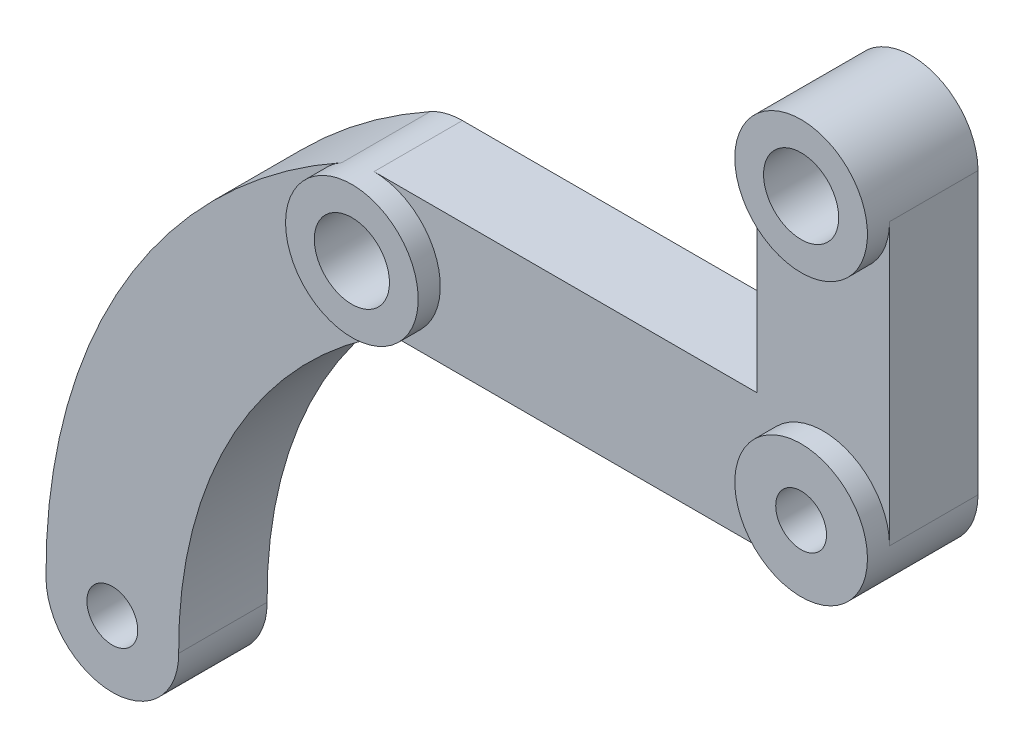
ISO-10303-21;
HEADER;
FILE_DESCRIPTION(('STEP AP214'),'2;1');
FILE_NAME('part.step','',(''),(''),'','','');
FILE_SCHEMA(('AUTOMOTIVE_DESIGN { 1 0 10303 214 1 1 1 1 }'));
ENDSEC;
DATA;
#1=APPLICATION_CONTEXT('core data for automotive mechanical design processes');
#2=APPLICATION_PROTOCOL_DEFINITION('international standard','automotive_design',2000,#1);
#3=PRODUCT_CONTEXT('',#1,'mechanical');
#4=PRODUCT('Part','Part','',(#3));
#5=PRODUCT_RELATED_PRODUCT_CATEGORY('part','',(#4));
#6=PRODUCT_DEFINITION_FORMATION('','',#4);
#7=PRODUCT_DEFINITION_CONTEXT('part definition',#1,'design');
#8=PRODUCT_DEFINITION('design','',#6,#7);
#9=PRODUCT_DEFINITION_SHAPE('','',#8);
#10=(LENGTH_UNIT() NAMED_UNIT(*) SI_UNIT(.MILLI.,.METRE.));
#11=(NAMED_UNIT(*) PLANE_ANGLE_UNIT() SI_UNIT($,.RADIAN.));
#12=(NAMED_UNIT(*) SI_UNIT($,.STERADIAN.) SOLID_ANGLE_UNIT());
#13=UNCERTAINTY_MEASURE_WITH_UNIT(LENGTH_MEASURE(1.E-05),#10,'distance_accuracy_value','');
#14=(GEOMETRIC_REPRESENTATION_CONTEXT(3) GLOBAL_UNCERTAINTY_ASSIGNED_CONTEXT((#13)) GLOBAL_UNIT_ASSIGNED_CONTEXT((#10,
#11,#12)) REPRESENTATION_CONTEXT('',''));
#15=CARTESIAN_POINT('',(0.,0.,0.));
#16=DIRECTION('',(0.,0.,1.));
#17=DIRECTION('',(1.,0.,0.));
#18=AXIS2_PLACEMENT_3D('',#15,#16,#17);
#19=CARTESIAN_POINT('',(-2.53999999999998,2.54000000000002,-5.));
#20=DIRECTION('',(0.,0.,1.));
#21=DIRECTION('',(-1.,0.,0.));
#22=AXIS2_PLACEMENT_3D('',#19,#20,#21);
#23=CYLINDRICAL_SURFACE('',#22,3.);
#24=CARTESIAN_POINT('',(-2.53999999999998,2.54000000000002,0.));
#25=DIRECTION('',(0.,0.,1.));
#26=DIRECTION('',(1.,0.,0.));
#27=AXIS2_PLACEMENT_3D('',#24,#25,#26);
#28=CIRCLE('',#27,3.);
#29=CARTESIAN_POINT('',(0.460000000000019,2.54000000000002,0.));
#30=VERTEX_POINT('',#29);
#31=EDGE_CURVE('E189',#30,#30,#28,.T.);
#32=ORIENTED_EDGE('',*,*,#31,.F.);
#33=EDGE_LOOP('',(#32));
#34=FACE_BOUND('',#33,.T.);
#35=CARTESIAN_POINT('',(-2.53999999999998,2.54000000000002,-5.));
#36=DIRECTION('',(0.,0.,1.));
#37=DIRECTION('',(1.,0.,0.));
#38=AXIS2_PLACEMENT_3D('',#35,#36,#37);
#39=CIRCLE('',#38,3.);
#40=CARTESIAN_POINT('',(-2.53999999999998,-0.459999999999989,-5.));
#41=VERTEX_POINT('',#40);
#42=CARTESIAN_POINT('',(0.460000000000041,2.54000000000002,-5.));
#43=VERTEX_POINT('',#42);
#44=EDGE_CURVE('E125',#41,#43,#39,.T.);
#45=ORIENTED_EDGE('',*,*,#44,.T.);
#46=DIRECTION('',(0.,0.,-1.));
#47=VECTOR('',#46,1.);
#48=CARTESIAN_POINT('',(0.460000000000041,2.54000000000002,14.0459958707099));
#49=LINE('',#48,#47);
#50=CARTESIAN_POINT('',(0.460000000000041,2.54000000000002,-1.00000000000001));
#51=VERTEX_POINT('',#50);
#52=EDGE_CURVE('E130',#51,#43,#49,.T.);
#53=ORIENTED_EDGE('',*,*,#52,.F.);
#54=CARTESIAN_POINT('',(-2.53999999999998,2.54000000000002,-1.00000000000001));
#55=DIRECTION('',(0.,0.,-1.));
#56=DIRECTION('',(-1.,0.,0.));
#57=AXIS2_PLACEMENT_3D('',#54,#55,#56);
#58=CIRCLE('',#57,3.);
#59=CARTESIAN_POINT('',(-2.53999999999998,-0.459999999999983,-1.00000000000001));
#60=VERTEX_POINT('',#59);
#61=EDGE_CURVE('E197',#60,#51,#58,.T.);
#62=ORIENTED_EDGE('',*,*,#61,.F.);
#63=DIRECTION('',(0.,0.,-1.));
#64=VECTOR('',#63,1.);
#65=CARTESIAN_POINT('',(-2.53999999999998,-0.459999999999983,20.1873169608612));
#66=LINE('',#65,#64);
#67=EDGE_CURVE('E143',#60,#41,#66,.T.);
#68=ORIENTED_EDGE('',*,*,#67,.T.);
#69=EDGE_LOOP('',(#45,#53,#62,#68));
#70=FACE_BOUND('',#69,.T.);
#71=ADVANCED_FACE('F39',(#34,#70),#23,.T.);
#72=CARTESIAN_POINT('',(-2.53999999999998,2.54000000000002,-5.00000000000013));
#73=DIRECTION('',(0.,0.,1.));
#74=DIRECTION('',(-1.,0.,0.));
#75=AXIS2_PLACEMENT_3D('',#72,#73,#74);
#76=CYLINDRICAL_SURFACE('',#75,1.15);
#77=CARTESIAN_POINT('',(-2.53999999999998,2.54000000000002,0.));
#78=DIRECTION('',(0.,0.,-1.));
#79=DIRECTION('',(-1.,0.,0.));
#80=AXIS2_PLACEMENT_3D('',#77,#78,#79);
#81=CIRCLE('',#80,1.15);
#82=CARTESIAN_POINT('',(-3.68999999999998,2.54000000000002,0.));
#83=VERTEX_POINT('',#82);
#84=EDGE_CURVE('E144',#83,#83,#81,.T.);
#85=ORIENTED_EDGE('',*,*,#84,.F.);
#86=EDGE_LOOP('',(#85));
#87=FACE_BOUND('',#86,.T.);
#88=CARTESIAN_POINT('',(-2.53999999999998,2.54000000000002,-5.));
#89=DIRECTION('',(0.,0.,1.));
#90=DIRECTION('',(1.,0.,0.));
#91=AXIS2_PLACEMENT_3D('',#88,#89,#90);
#92=CIRCLE('',#91,1.15);
#93=CARTESIAN_POINT('',(-1.38999999999998,2.54000000000002,-5.));
#94=VERTEX_POINT('',#93);
#95=EDGE_CURVE('E43',#94,#94,#92,.F.);
#96=ORIENTED_EDGE('',*,*,#95,.T.);
#97=EDGE_LOOP('',(#96));
#98=FACE_BOUND('',#97,.T.);
#99=ADVANCED_FACE('F268',(#87,#98),#76,.F.);
#100=CARTESIAN_POINT('',(-22.86,2.54000000000002,-5.));
#101=DIRECTION('',(0.,0.,1.));
#102=DIRECTION('',(-1.,0.,0.));
#103=AXIS2_PLACEMENT_3D('',#100,#101,#102);
#104=CYLINDRICAL_SURFACE('',#103,3.);
#105=DIRECTION('',(0.,0.,-1.));
#106=VECTOR('',#105,1.);
#107=CARTESIAN_POINT('',(-22.86,5.54000000000001,20.1873169608612));
#108=LINE('',#107,#106);
#109=CARTESIAN_POINT('',(-22.86,5.54000000000002,-1.00000000000005));
#110=VERTEX_POINT('',#109);
#111=CARTESIAN_POINT('',(-22.86,5.54000000000002,-5.));
#112=VERTEX_POINT('',#111);
#113=EDGE_CURVE('E174',#110,#112,#108,.T.);
#114=ORIENTED_EDGE('',*,*,#113,.T.);
#115=CARTESIAN_POINT('',(-22.86,2.54000000000002,-5.));
#116=DIRECTION('',(0.,0.,1.));
#117=DIRECTION('',(-1.,0.,0.));
#118=AXIS2_PLACEMENT_3D('',#115,#116,#117);
#119=CIRCLE('',#118,3.);
#120=CARTESIAN_POINT('',(-24.3161661411759,5.16289537902159,-5.));
#121=VERTEX_POINT('',#120);
#122=EDGE_CURVE('E224',#112,#121,#119,.T.);
#123=ORIENTED_EDGE('',*,*,#122,.T.);
#124=DIRECTION('',(0.,0.,1.));
#125=VECTOR('',#124,1.);
#126=CARTESIAN_POINT('',(-24.3161661411758,5.1628953790216,-35.6297382466008));
#127=LINE('',#126,#125);
#128=CARTESIAN_POINT('',(-24.3161661411759,5.1628953790216,-1.00000000000009));
#129=VERTEX_POINT('',#128);
#130=EDGE_CURVE('E212',#121,#129,#127,.T.);
#131=ORIENTED_EDGE('',*,*,#130,.T.);
#132=CARTESIAN_POINT('',(-22.86,2.54000000000002,-1.00000000000008));
#133=DIRECTION('',(0.,0.,1.));
#134=DIRECTION('',(1.,0.,0.));
#135=AXIS2_PLACEMENT_3D('',#132,#133,#134);
#136=CIRCLE('',#135,3.);
#137=EDGE_CURVE('E48',#129,#110,#136,.T.);
#138=ORIENTED_EDGE('',*,*,#137,.T.);
#139=EDGE_LOOP('',(#114,#123,#131,#138));
#140=FACE_BOUND('',#139,.T.);
#141=CARTESIAN_POINT('',(-22.86,2.54000000000002,0.));
#142=DIRECTION('',(0.,0.,1.));
#143=DIRECTION('',(-1.,0.,0.));
#144=AXIS2_PLACEMENT_3D('',#141,#142,#143);
#145=CIRCLE('',#144,3.);
#146=CARTESIAN_POINT('',(-25.86,2.54000000000002,0.));
#147=VERTEX_POINT('',#146);
#148=EDGE_CURVE('E225',#147,#147,#145,.T.);
#149=ORIENTED_EDGE('',*,*,#148,.F.);
#150=EDGE_LOOP('',(#149));
#151=FACE_BOUND('',#150,.T.);
#152=ADVANCED_FACE('F231',(#140,#151),#104,.T.);
#153=CARTESIAN_POINT('',(-22.86,2.54000000000002,-5.));
#154=DIRECTION('',(0.,0.,1.));
#155=DIRECTION('',(-1.,0.,0.));
#156=AXIS2_PLACEMENT_3D('',#153,#154,#155);
#157=PLANE('',#156);
#158=CARTESIAN_POINT('',(-34.6951410360799,-17.7744183979452,-5.00000000000012));
#159=DIRECTION('',(0.,0.,-1.));
#160=DIRECTION('',(-1.,0.,0.));
#161=AXIS2_PLACEMENT_3D('',#158,#159,#160);
#162=CIRCLE('',#161,1.15000000000187);
#163=CARTESIAN_POINT('',(-35.8451410360818,-17.7744183979452,-5.00000000000013));
#164=VERTEX_POINT('',#163);
#165=EDGE_CURVE('E151',#164,#164,#162,.T.);
#166=ORIENTED_EDGE('',*,*,#165,.F.);
#167=EDGE_LOOP('',(#166));
#168=FACE_BOUND('',#167,.T.);
#169=DIRECTION('',(1.,0.,0.));
#170=VECTOR('',#169,1.);
#171=CARTESIAN_POINT('',(-22.86,-0.459999999999981,-5.));
#172=LINE('',#171,#170);
#173=CARTESIAN_POINT('',(-22.0539914744151,-0.459999999999985,-5.));
#174=VERTEX_POINT('',#173);
#175=EDGE_CURVE('E160',#174,#41,#172,.T.);
#176=ORIENTED_EDGE('',*,*,#175,.F.);
#177=CARTESIAN_POINT('',(-11.6960595843177,-17.5688645724988,-5.));
#178=DIRECTION('',(0.,0.,1.));
#179=DIRECTION('',(1.,0.,0.));
#180=AXIS2_PLACEMENT_3D('',#177,#178,#179);
#181=CIRCLE('',#180,20.);
#182=CARTESIAN_POINT('',(-31.6952608467206,-17.7476070294087,-5.));
#183=VERTEX_POINT('',#182);
#184=EDGE_CURVE('E205',#174,#183,#181,.T.);
#185=ORIENTED_EDGE('',*,*,#184,.T.);
#186=CARTESIAN_POINT('',(-34.6951410360799,-17.7744183979452,-5.));
#187=DIRECTION('',(0.,0.,1.));
#188=DIRECTION('',(1.,0.,0.));
#189=AXIS2_PLACEMENT_3D('',#186,#187,#188);
#190=CIRCLE('',#189,3.00000000000014);
#191=CARTESIAN_POINT('',(-37.6950212254405,-17.8012297664817,-5.));
#192=VERTEX_POINT('',#191);
#193=EDGE_CURVE('E214',#183,#192,#190,.F.);
#194=ORIENTED_EDGE('',*,*,#193,.T.);
#195=CARTESIAN_POINT('',(-11.6960595843177,-17.5688645724988,-5.));
#196=DIRECTION('',(0.,0.,1.));
#197=DIRECTION('',(1.,0.,0.));
#198=AXIS2_PLACEMENT_3D('',#195,#196,#197);
#199=CIRCLE('',#198,26.0000000000001);
#200=EDGE_CURVE('E210',#192,#121,#199,.F.);
#201=ORIENTED_EDGE('',*,*,#200,.T.);
#202=ORIENTED_EDGE('',*,*,#122,.F.);
#203=DIRECTION('',(-1.,0.,0.));
#204=VECTOR('',#203,1.);
#205=CARTESIAN_POINT('',(-22.86,5.54000000000001,-5.));
#206=LINE('',#205,#204);
#207=CARTESIAN_POINT('',(-5.53999999999996,5.54000000000002,-5.));
#208=VERTEX_POINT('',#207);
#209=EDGE_CURVE('E63',#208,#112,#206,.T.);
#210=ORIENTED_EDGE('',*,*,#209,.F.);
#211=DIRECTION('',(0.,-1.,0.));
#212=VECTOR('',#211,1.);
#213=CARTESIAN_POINT('',(-5.53999999999996,15.24,-5.));
#214=LINE('',#213,#212);
#215=CARTESIAN_POINT('',(-5.53999999999996,15.24,-5.));
#216=VERTEX_POINT('',#215);
#217=EDGE_CURVE('E131',#216,#208,#214,.T.);
#218=ORIENTED_EDGE('',*,*,#217,.F.);
#219=CARTESIAN_POINT('',(-2.53999999999998,15.24,-5.));
#220=DIRECTION('',(0.,0.,1.));
#221=DIRECTION('',(-1.,0.,0.));
#222=AXIS2_PLACEMENT_3D('',#219,#220,#221);
#223=CIRCLE('',#222,3.);
#224=CARTESIAN_POINT('',(0.460000000000038,15.24,-5.));
#225=VERTEX_POINT('',#224);
#226=EDGE_CURVE('E128',#225,#216,#223,.T.);
#227=ORIENTED_EDGE('',*,*,#226,.F.);
#228=DIRECTION('',(0.,1.,0.));
#229=VECTOR('',#228,1.);
#230=CARTESIAN_POINT('',(0.460000000000038,15.24,-5.));
#231=LINE('',#230,#229);
#232=EDGE_CURVE('E120',#43,#225,#231,.T.);
#233=ORIENTED_EDGE('',*,*,#232,.F.);
#234=ORIENTED_EDGE('',*,*,#44,.F.);
#235=EDGE_LOOP('',(#176,#185,#194,#201,#202,#210,#218,#227,#233,#234));
#236=FACE_BOUND('',#235,.T.);
#237=ORIENTED_EDGE('',*,*,#95,.F.);
#238=EDGE_LOOP('',(#237));
#239=FACE_BOUND('',#238,.T.);
#240=ADVANCED_FACE('F41',(#168,#236,#239),#157,.F.);
#241=CARTESIAN_POINT('',(-22.86,2.54000000000002,0.));
#242=DIRECTION('',(0.,0.,1.));
#243=DIRECTION('',(-1.,0.,0.));
#244=AXIS2_PLACEMENT_3D('',#241,#242,#243);
#245=PLANE('',#244);
#246=CARTESIAN_POINT('',(-22.86,2.54000000000002,0.));
#247=DIRECTION('',(0.,0.,-1.));
#248=DIRECTION('',(1.,0.,0.));
#249=AXIS2_PLACEMENT_3D('',#246,#247,#248);
#250=CIRCLE('',#249,1.7);
#251=CARTESIAN_POINT('',(-21.16,2.54000000000002,0.));
#252=VERTEX_POINT('',#251);
#253=EDGE_CURVE('E164',#252,#252,#250,.T.);
#254=ORIENTED_EDGE('',*,*,#253,.T.);
#255=EDGE_LOOP('',(#254));
#256=FACE_BOUND('',#255,.T.);
#257=ORIENTED_EDGE('',*,*,#148,.T.);
#258=EDGE_LOOP('',(#257));
#259=FACE_BOUND('',#258,.T.);
#260=ADVANCED_FACE('F283',(#256,#259),#245,.T.);
#261=CARTESIAN_POINT('',(-11.6960595843177,-17.5688645724988,-1.00000000000004));
#262=DIRECTION('',(0.,0.,-1.));
#263=DIRECTION('',(1.,0.,0.));
#264=AXIS2_PLACEMENT_3D('',#261,#262,#263);
#265=PLANE('',#264);
#266=CARTESIAN_POINT('',(-34.69514103608,-17.7744183979452,-1.00000000000012));
#267=DIRECTION('',(0.,0.,-1.));
#268=DIRECTION('',(-1.,0.,0.));
#269=AXIS2_PLACEMENT_3D('',#266,#267,#268);
#270=CIRCLE('',#269,1.15000000000187);
#271=CARTESIAN_POINT('',(-35.8451410360818,-17.7744183979452,-1.00000000000013));
#272=VERTEX_POINT('',#271);
#273=EDGE_CURVE('E147',#272,#272,#270,.T.);
#274=ORIENTED_EDGE('',*,*,#273,.T.);
#275=EDGE_LOOP('',(#274));
#276=FACE_BOUND('',#275,.T.);
#277=CARTESIAN_POINT('',(-11.6960595843177,-17.5688645724988,-1.00000000000004));
#278=DIRECTION('',(0.,0.,1.));
#279=DIRECTION('',(1.,0.,0.));
#280=AXIS2_PLACEMENT_3D('',#277,#278,#279);
#281=CIRCLE('',#280,20.);
#282=CARTESIAN_POINT('',(-22.0539914744151,-0.459999999999981,-1.00000000000008));
#283=VERTEX_POINT('',#282);
#284=CARTESIAN_POINT('',(-31.6952608467206,-17.7476070294087,-1.00000000000011));
#285=VERTEX_POINT('',#284);
#286=EDGE_CURVE('E206',#283,#285,#281,.T.);
#287=ORIENTED_EDGE('',*,*,#286,.F.);
#288=DIRECTION('',(1.,0.,0.));
#289=VECTOR('',#288,1.);
#290=CARTESIAN_POINT('',(-22.8599999999999,-0.459999999999981,-1.00000000000008));
#291=LINE('',#290,#289);
#292=EDGE_CURVE('E170',#283,#60,#291,.T.);
#293=ORIENTED_EDGE('',*,*,#292,.T.);
#294=ORIENTED_EDGE('',*,*,#61,.T.);
#295=DIRECTION('',(0.,1.,0.));
#296=VECTOR('',#295,1.);
#297=CARTESIAN_POINT('',(0.460000000000038,15.24,-0.999999999999999));
#298=LINE('',#297,#296);
#299=CARTESIAN_POINT('',(0.460000000000038,15.24,-0.999999999999999));
#300=VERTEX_POINT('',#299);
#301=EDGE_CURVE('E136',#51,#300,#298,.T.);
#302=ORIENTED_EDGE('',*,*,#301,.T.);
#303=CARTESIAN_POINT('',(-2.53999999999998,15.24,-1.00000000000001));
#304=DIRECTION('',(0.,0.,-1.));
#305=DIRECTION('',(-1.,0.,0.));
#306=AXIS2_PLACEMENT_3D('',#303,#304,#305);
#307=CIRCLE('',#306,3.);
#308=CARTESIAN_POINT('',(-5.53999999999996,15.24,-1.00000000000002));
#309=VERTEX_POINT('',#308);
#310=EDGE_CURVE('E181',#309,#300,#307,.F.);
#311=ORIENTED_EDGE('',*,*,#310,.F.);
#312=DIRECTION('',(0.,-1.,0.));
#313=VECTOR('',#312,1.);
#314=CARTESIAN_POINT('',(-5.53999999999996,15.24,-1.00000000000002));
#315=LINE('',#314,#313);
#316=CARTESIAN_POINT('',(-5.53999999999996,5.54000000000002,-1.00000000000002));
#317=VERTEX_POINT('',#316);
#318=EDGE_CURVE('E187',#309,#317,#315,.T.);
#319=ORIENTED_EDGE('',*,*,#318,.T.);
#320=DIRECTION('',(-1.,0.,0.));
#321=VECTOR('',#320,1.);
#322=CARTESIAN_POINT('',(-22.8599999999999,5.54000000000001,-1.00000000000008));
#323=LINE('',#322,#321);
#324=EDGE_CURVE('E55',#317,#110,#323,.T.);
#325=ORIENTED_EDGE('',*,*,#324,.T.);
#326=ORIENTED_EDGE('',*,*,#137,.F.);
#327=CARTESIAN_POINT('',(-11.6960595843177,-17.5688645724988,-1.00000000000004));
#328=DIRECTION('',(0.,0.,-1.));
#329=DIRECTION('',(1.,0.,0.));
#330=AXIS2_PLACEMENT_3D('',#327,#328,#329);
#331=CIRCLE('',#330,26.0000000000001);
#332=CARTESIAN_POINT('',(-37.6950212254405,-17.8012297664817,-1.00000000000013));
#333=VERTEX_POINT('',#332);
#334=EDGE_CURVE('E201',#333,#129,#331,.T.);
#335=ORIENTED_EDGE('',*,*,#334,.F.);
#336=CARTESIAN_POINT('',(-34.69514103608,-17.7744183979452,-1.00000000000012));
#337=DIRECTION('',(0.,0.,-1.));
#338=DIRECTION('',(1.,0.,0.));
#339=AXIS2_PLACEMENT_3D('',#336,#337,#338);
#340=CIRCLE('',#339,3.00000000000014);
#341=EDGE_CURVE('E202',#285,#333,#340,.T.);
#342=ORIENTED_EDGE('',*,*,#341,.F.);
#343=EDGE_LOOP('',(#287,#293,#294,#302,#311,#319,#325,#326,#335,#342));
#344=FACE_BOUND('',#343,.T.);
#345=ADVANCED_FACE('F239',(#276,#344),#265,.F.);
#346=CARTESIAN_POINT('',(-11.6960595843176,-17.5688645724988,-35.6297382466008));
#347=DIRECTION('',(0.,0.,1.));
#348=DIRECTION('',(-1.,0.,0.));
#349=AXIS2_PLACEMENT_3D('',#346,#347,#348);
#350=CYLINDRICAL_SURFACE('',#349,20.);
#351=DIRECTION('',(0.,0.,1.));
#352=VECTOR('',#351,1.);
#353=CARTESIAN_POINT('',(-22.053991474415,-0.45999999999998,-35.6297382466008));
#354=LINE('',#353,#352);
#355=EDGE_CURVE('E11',#174,#283,#354,.T.);
#356=ORIENTED_EDGE('',*,*,#355,.T.);
#357=ORIENTED_EDGE('',*,*,#286,.T.);
#358=DIRECTION('',(0.,0.,1.));
#359=VECTOR('',#358,1.);
#360=CARTESIAN_POINT('',(-31.6952608467205,-17.7476070294087,-35.6297382466008));
#361=LINE('',#360,#359);
#362=EDGE_CURVE('E217',#183,#285,#361,.T.);
#363=ORIENTED_EDGE('',*,*,#362,.F.);
#364=ORIENTED_EDGE('',*,*,#184,.F.);
#365=EDGE_LOOP('',(#356,#357,#363,#364));
#366=FACE_BOUND('',#365,.T.);
#367=ADVANCED_FACE('F249',(#366),#350,.F.);
#368=CARTESIAN_POINT('',(-34.6951410360798,-17.7744183979452,-35.6297382466008));
#369=DIRECTION('',(0.,0.,1.));
#370=DIRECTION('',(-1.,0.,0.));
#371=AXIS2_PLACEMENT_3D('',#368,#369,#370);
#372=CYLINDRICAL_SURFACE('',#371,3.00000000000014);
#373=ORIENTED_EDGE('',*,*,#362,.T.);
#374=ORIENTED_EDGE('',*,*,#341,.T.);
#375=DIRECTION('',(0.,0.,1.));
#376=VECTOR('',#375,1.);
#377=CARTESIAN_POINT('',(-37.6950212254404,-17.8012297664817,-35.6297382466009));
#378=LINE('',#377,#376);
#379=EDGE_CURVE('E213',#192,#333,#378,.T.);
#380=ORIENTED_EDGE('',*,*,#379,.F.);
#381=ORIENTED_EDGE('',*,*,#193,.F.);
#382=EDGE_LOOP('',(#373,#374,#380,#381));
#383=FACE_BOUND('',#382,.T.);
#384=ADVANCED_FACE('F287',(#383),#372,.T.);
#385=CARTESIAN_POINT('',(-11.6960595843176,-17.5688645724988,-35.6297382466008));
#386=DIRECTION('',(0.,0.,1.));
#387=DIRECTION('',(-1.,0.,0.));
#388=AXIS2_PLACEMENT_3D('',#385,#386,#387);
#389=CYLINDRICAL_SURFACE('',#388,26.0000000000001);
#390=ORIENTED_EDGE('',*,*,#379,.T.);
#391=ORIENTED_EDGE('',*,*,#334,.T.);
#392=ORIENTED_EDGE('',*,*,#130,.F.);
#393=ORIENTED_EDGE('',*,*,#200,.F.);
#394=EDGE_LOOP('',(#390,#391,#392,#393));
#395=FACE_BOUND('',#394,.T.);
#396=ADVANCED_FACE('F245',(#395),#389,.T.);
#397=CARTESIAN_POINT('',(-2.53999999999998,2.54000000000002,0.));
#398=DIRECTION('',(0.,0.,-1.));
#399=DIRECTION('',(1.,0.,0.));
#400=AXIS2_PLACEMENT_3D('',#397,#398,#399);
#401=PLANE('',#400);
#402=ORIENTED_EDGE('',*,*,#84,.T.);
#403=EDGE_LOOP('',(#402));
#404=FACE_BOUND('',#403,.T.);
#405=ORIENTED_EDGE('',*,*,#31,.T.);
#406=EDGE_LOOP('',(#405));
#407=FACE_BOUND('',#406,.T.);
#408=ADVANCED_FACE('F279',(#404,#407),#401,.F.);
#409=CARTESIAN_POINT('',(0.460000000000038,15.24,14.0459958707099));
#410=DIRECTION('',(1.,0.,0.));
#411=DIRECTION('',(0.,1.,0.));
#412=AXIS2_PLACEMENT_3D('',#409,#410,#411);
#413=PLANE('',#412);
#414=ORIENTED_EDGE('',*,*,#52,.T.);
#415=ORIENTED_EDGE('',*,*,#232,.T.);
#416=DIRECTION('',(0.,0.,-1.));
#417=VECTOR('',#416,1.);
#418=CARTESIAN_POINT('',(0.460000000000038,15.24,14.0459958707099));
#419=LINE('',#418,#417);
#420=EDGE_CURVE('E192',#300,#225,#419,.T.);
#421=ORIENTED_EDGE('',*,*,#420,.F.);
#422=ORIENTED_EDGE('',*,*,#301,.F.);
#423=EDGE_LOOP('',(#414,#415,#421,#422));
#424=FACE_BOUND('',#423,.T.);
#425=ADVANCED_FACE('F134',(#424),#413,.T.);
#426=CARTESIAN_POINT('',(-5.53999999999996,15.24,14.0459958707099));
#427=DIRECTION('',(-1.,0.,0.));
#428=DIRECTION('',(0.,-1.,0.));
#429=AXIS2_PLACEMENT_3D('',#426,#427,#428);
#430=PLANE('',#429);
#431=DIRECTION('',(0.,0.,1.));
#432=VECTOR('',#431,1.);
#433=CARTESIAN_POINT('',(-5.53999999999996,5.54000000000002,14.0459958707099));
#434=LINE('',#433,#432);
#435=EDGE_CURVE('E199',#208,#317,#434,.T.);
#436=ORIENTED_EDGE('',*,*,#435,.T.);
#437=ORIENTED_EDGE('',*,*,#318,.F.);
#438=DIRECTION('',(0.,0.,-1.));
#439=VECTOR('',#438,1.);
#440=CARTESIAN_POINT('',(-5.53999999999996,15.24,14.0459958707099));
#441=LINE('',#440,#439);
#442=EDGE_CURVE('E190',#309,#216,#441,.T.);
#443=ORIENTED_EDGE('',*,*,#442,.T.);
#444=ORIENTED_EDGE('',*,*,#217,.T.);
#445=EDGE_LOOP('',(#436,#437,#443,#444));
#446=FACE_BOUND('',#445,.T.);
#447=ADVANCED_FACE('F241',(#446),#430,.T.);
#448=CARTESIAN_POINT('',(-2.53999999999998,15.24,-5.));
#449=DIRECTION('',(0.,0.,1.));
#450=DIRECTION('',(-1.,0.,0.));
#451=AXIS2_PLACEMENT_3D('',#448,#449,#450);
#452=CYLINDRICAL_SURFACE('',#451,3.);
#453=ORIENTED_EDGE('',*,*,#420,.T.);
#454=ORIENTED_EDGE('',*,*,#226,.T.);
#455=ORIENTED_EDGE('',*,*,#442,.F.);
#456=ORIENTED_EDGE('',*,*,#310,.T.);
#457=EDGE_LOOP('',(#453,#454,#455,#456));
#458=FACE_BOUND('',#457,.T.);
#459=CARTESIAN_POINT('',(-2.53999999999998,15.24,0.));
#460=DIRECTION('',(0.,0.,1.));
#461=DIRECTION('',(-1.,0.,0.));
#462=AXIS2_PLACEMENT_3D('',#459,#460,#461);
#463=CIRCLE('',#462,3.);
#464=CARTESIAN_POINT('',(-5.53999999999998,15.24,0.));
#465=VERTEX_POINT('',#464);
#466=EDGE_CURVE('E178',#465,#465,#463,.T.);
#467=ORIENTED_EDGE('',*,*,#466,.F.);
#468=EDGE_LOOP('',(#467));
#469=FACE_BOUND('',#468,.T.);
#470=ADVANCED_FACE('F263',(#458,#469),#452,.T.);
#471=CARTESIAN_POINT('',(-2.53999999999998,15.24,0.));
#472=DIRECTION('',(0.,0.,1.));
#473=DIRECTION('',(-1.,0.,0.));
#474=AXIS2_PLACEMENT_3D('',#471,#472,#473);
#475=PLANE('',#474);
#476=CARTESIAN_POINT('',(-2.53999999999998,15.24,0.));
#477=DIRECTION('',(0.,0.,-1.));
#478=DIRECTION('',(-1.,0.,0.));
#479=AXIS2_PLACEMENT_3D('',#476,#477,#478);
#480=CIRCLE('',#479,1.7);
#481=CARTESIAN_POINT('',(-4.23999999999998,15.24,0.));
#482=VERTEX_POINT('',#481);
#483=EDGE_CURVE('E161',#482,#482,#480,.T.);
#484=ORIENTED_EDGE('',*,*,#483,.T.);
#485=EDGE_LOOP('',(#484));
#486=FACE_BOUND('',#485,.T.);
#487=ORIENTED_EDGE('',*,*,#466,.T.);
#488=EDGE_LOOP('',(#487));
#489=FACE_BOUND('',#488,.T.);
#490=ADVANCED_FACE('F255',(#486,#489),#475,.T.);
#491=CARTESIAN_POINT('',(-22.86,-0.459999999999981,20.1873169608612));
#492=DIRECTION('',(0.,-1.,0.));
#493=DIRECTION('',(1.,0.,0.));
#494=AXIS2_PLACEMENT_3D('',#491,#492,#493);
#495=PLANE('',#494);
#496=ORIENTED_EDGE('',*,*,#175,.T.);
#497=ORIENTED_EDGE('',*,*,#67,.F.);
#498=ORIENTED_EDGE('',*,*,#292,.F.);
#499=ORIENTED_EDGE('',*,*,#355,.F.);
#500=EDGE_LOOP('',(#496,#497,#498,#499));
#501=FACE_BOUND('',#500,.T.);
#502=ADVANCED_FACE('F253',(#501),#495,.T.);
#503=CARTESIAN_POINT('',(-22.86,5.54000000000001,20.1873169608612));
#504=DIRECTION('',(0.,1.,0.));
#505=DIRECTION('',(-1.,0.,0.));
#506=AXIS2_PLACEMENT_3D('',#503,#504,#505);
#507=PLANE('',#506);
#508=ORIENTED_EDGE('',*,*,#209,.T.);
#509=ORIENTED_EDGE('',*,*,#113,.F.);
#510=ORIENTED_EDGE('',*,*,#324,.F.);
#511=ORIENTED_EDGE('',*,*,#435,.F.);
#512=EDGE_LOOP('',(#508,#509,#510,#511));
#513=FACE_BOUND('',#512,.T.);
#514=ADVANCED_FACE('F235',(#513),#507,.T.);
#515=CARTESIAN_POINT('',(-2.53999999999998,15.24,-4.));
#516=DIRECTION('',(0.,0.,1.));
#517=DIRECTION('',(-1.,0.,0.));
#518=AXIS2_PLACEMENT_3D('',#515,#516,#517);
#519=CYLINDRICAL_SURFACE('',#518,1.7);
#520=CARTESIAN_POINT('',(-2.53999999999998,15.24,-4.));
#521=DIRECTION('',(0.,0.,-1.));
#522=DIRECTION('',(-1.,0.,0.));
#523=AXIS2_PLACEMENT_3D('',#520,#521,#522);
#524=CIRCLE('',#523,1.7);
#525=CARTESIAN_POINT('',(-4.23999999999998,15.24,-4.));
#526=VERTEX_POINT('',#525);
#527=EDGE_CURVE('E157',#526,#526,#524,.T.);
#528=ORIENTED_EDGE('',*,*,#527,.T.);
#529=EDGE_LOOP('',(#528));
#530=FACE_BOUND('',#529,.T.);
#531=ORIENTED_EDGE('',*,*,#483,.F.);
#532=EDGE_LOOP('',(#531));
#533=FACE_BOUND('',#532,.T.);
#534=ADVANCED_FACE('F261',(#530,#533),#519,.F.);
#535=CARTESIAN_POINT('',(-2.53999999999998,15.24,-4.));
#536=DIRECTION('',(0.,0.,1.));
#537=DIRECTION('',(-1.,0.,0.));
#538=AXIS2_PLACEMENT_3D('',#535,#536,#537);
#539=PLANE('',#538);
#540=ORIENTED_EDGE('',*,*,#527,.F.);
#541=EDGE_LOOP('',(#540));
#542=FACE_BOUND('',#541,.T.);
#543=ADVANCED_FACE('F306',(#542),#539,.T.);
#544=CARTESIAN_POINT('',(-22.86,2.54000000000002,-4.));
#545=DIRECTION('',(0.,0.,1.));
#546=DIRECTION('',(-1.,0.,0.));
#547=AXIS2_PLACEMENT_3D('',#544,#545,#546);
#548=CYLINDRICAL_SURFACE('',#547,1.7);
#549=CARTESIAN_POINT('',(-22.86,2.54000000000002,-4.));
#550=DIRECTION('',(0.,0.,-1.));
#551=DIRECTION('',(1.,0.,0.));
#552=AXIS2_PLACEMENT_3D('',#549,#550,#551);
#553=CIRCLE('',#552,1.7);
#554=CARTESIAN_POINT('',(-21.16,2.54000000000002,-4.));
#555=VERTEX_POINT('',#554);
#556=EDGE_CURVE('E154',#555,#555,#553,.T.);
#557=ORIENTED_EDGE('',*,*,#556,.T.);
#558=EDGE_LOOP('',(#557));
#559=FACE_BOUND('',#558,.T.);
#560=ORIENTED_EDGE('',*,*,#253,.F.);
#561=EDGE_LOOP('',(#560));
#562=FACE_BOUND('',#561,.T.);
#563=ADVANCED_FACE('F303',(#559,#562),#548,.F.);
#564=CARTESIAN_POINT('',(-22.86,2.54000000000002,-4.));
#565=DIRECTION('',(0.,0.,-1.));
#566=DIRECTION('',(1.,0.,0.));
#567=AXIS2_PLACEMENT_3D('',#564,#565,#566);
#568=PLANE('',#567);
#569=ORIENTED_EDGE('',*,*,#556,.F.);
#570=EDGE_LOOP('',(#569));
#571=FACE_BOUND('',#570,.T.);
#572=ADVANCED_FACE('F305',(#571),#568,.F.);
#573=CARTESIAN_POINT('',(-34.6951410360799,-17.7744183979452,-5.00000000000012));
#574=DIRECTION('',(0.,0.,1.));
#575=DIRECTION('',(-1.,0.,0.));
#576=AXIS2_PLACEMENT_3D('',#573,#574,#575);
#577=CYLINDRICAL_SURFACE('',#576,1.15000000000187);
#578=ORIENTED_EDGE('',*,*,#165,.T.);
#579=EDGE_LOOP('',(#578));
#580=FACE_BOUND('',#579,.T.);
#581=ORIENTED_EDGE('',*,*,#273,.F.);
#582=EDGE_LOOP('',(#581));
#583=FACE_BOUND('',#582,.T.);
#584=ADVANCED_FACE('F313',(#580,#583),#577,.F.);
#585=CLOSED_SHELL('',(#71,#99,#152,#240,#260,#345,#367,#384,#396,#408,#425,#447,#470,#490,#502,
#514,#534,#543,#563,#572,#584));
#586=MANIFOLD_SOLID_BREP('B2',#585);
#587=ADVANCED_BREP_SHAPE_REPRESENTATION('',(#18,#586),#14);
#588=SHAPE_DEFINITION_REPRESENTATION(#9,#587);
ENDSEC;
END-ISO-10303-21;
